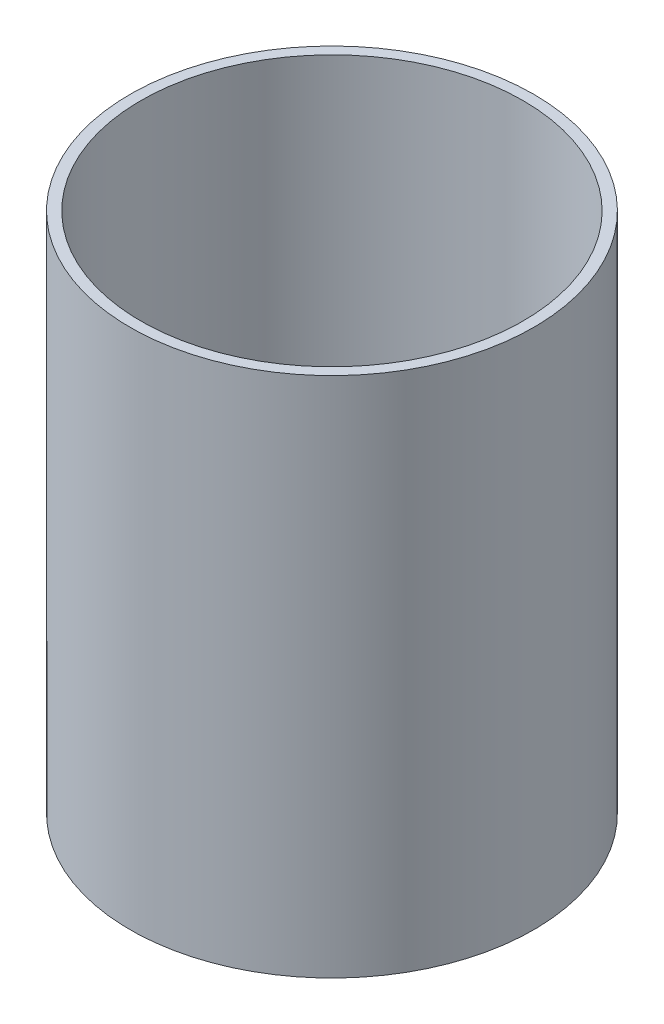
ISO-10303-21;
HEADER;
FILE_DESCRIPTION(('STEP AP214'),'2;1');
FILE_NAME('part.step','',(''),(''),'','','');
FILE_SCHEMA(('AUTOMOTIVE_DESIGN { 1 0 10303 214 1 1 1 1 }'));
ENDSEC;
DATA;
#1=APPLICATION_CONTEXT('core data for automotive mechanical design processes');
#2=APPLICATION_PROTOCOL_DEFINITION('international standard','automotive_design',2000,#1);
#3=PRODUCT_CONTEXT('',#1,'mechanical');
#4=PRODUCT('Part','Part','',(#3));
#5=PRODUCT_RELATED_PRODUCT_CATEGORY('part','',(#4));
#6=PRODUCT_DEFINITION_FORMATION('','',#4);
#7=PRODUCT_DEFINITION_CONTEXT('part definition',#1,'design');
#8=PRODUCT_DEFINITION('design','',#6,#7);
#9=PRODUCT_DEFINITION_SHAPE('','',#8);
#10=(LENGTH_UNIT() NAMED_UNIT(*) SI_UNIT(.MILLI.,.METRE.));
#11=(NAMED_UNIT(*) PLANE_ANGLE_UNIT() SI_UNIT($,.RADIAN.));
#12=(NAMED_UNIT(*) SI_UNIT($,.STERADIAN.) SOLID_ANGLE_UNIT());
#13=UNCERTAINTY_MEASURE_WITH_UNIT(LENGTH_MEASURE(1.E-05),#10,'distance_accuracy_value','');
#14=(GEOMETRIC_REPRESENTATION_CONTEXT(3) GLOBAL_UNCERTAINTY_ASSIGNED_CONTEXT((#13)) GLOBAL_UNIT_ASSIGNED_CONTEXT((#10,
#11,#12)) REPRESENTATION_CONTEXT('',''));
#15=CARTESIAN_POINT('',(0.,0.,0.));
#16=DIRECTION('',(0.,0.,1.));
#17=DIRECTION('',(1.,0.,0.));
#18=AXIS2_PLACEMENT_3D('',#15,#16,#17);
#19=CARTESIAN_POINT('',(0.,-13.97,0.));
#20=DIRECTION('',(0.,-1.,0.));
#21=DIRECTION('',(0.,0.,-1.));
#22=AXIS2_PLACEMENT_3D('',#19,#20,#21);
#23=CYLINDRICAL_SURFACE('',#22,26.9748);
#24=CARTESIAN_POINT('',(0.,0.,0.));
#25=DIRECTION('',(0.,-1.,0.));
#26=DIRECTION('',(0.,0.,-1.));
#27=AXIS2_PLACEMENT_3D('',#24,#25,#26);
#28=CIRCLE('',#27,26.9748);
#29=CARTESIAN_POINT('',(0.,0.,-26.9748));
#30=VERTEX_POINT('',#29);
#31=EDGE_CURVE('E48',#30,#30,#28,.T.);
#32=ORIENTED_EDGE('',*,*,#31,.T.);
#33=EDGE_LOOP('',(#32));
#34=FACE_BOUND('',#33,.T.);
#35=CARTESIAN_POINT('',(0.,73.66,0.));
#36=DIRECTION('',(0.,-1.,0.));
#37=DIRECTION('',(0.,0.,-1.));
#38=AXIS2_PLACEMENT_3D('',#35,#36,#37);
#39=CIRCLE('',#38,26.9748);
#40=CARTESIAN_POINT('',(0.,73.66,-26.9748));
#41=VERTEX_POINT('',#40);
#42=EDGE_CURVE('E10',#41,#41,#39,.T.);
#43=ORIENTED_EDGE('',*,*,#42,.F.);
#44=EDGE_LOOP('',(#43));
#45=FACE_BOUND('',#44,.T.);
#46=ADVANCED_FACE('F34',(#34,#45),#23,.F.);
#47=CARTESIAN_POINT('',(26.9748,73.66,0.));
#48=DIRECTION('',(0.,1.,0.));
#49=DIRECTION('',(0.,0.,1.));
#50=AXIS2_PLACEMENT_3D('',#47,#48,#49);
#51=PLANE('',#50);
#52=ORIENTED_EDGE('',*,*,#42,.T.);
#53=EDGE_LOOP('',(#52));
#54=FACE_BOUND('',#53,.T.);
#55=CARTESIAN_POINT('',(0.,73.66,0.));
#56=DIRECTION('',(0.,-1.,0.));
#57=DIRECTION('',(0.,0.,-1.));
#58=AXIS2_PLACEMENT_3D('',#55,#56,#57);
#59=CIRCLE('',#58,28.4988);
#60=CARTESIAN_POINT('',(0.,73.66,-28.4988));
#61=VERTEX_POINT('',#60);
#62=EDGE_CURVE('E40',#61,#61,#59,.T.);
#63=ORIENTED_EDGE('',*,*,#62,.F.);
#64=EDGE_LOOP('',(#63));
#65=FACE_BOUND('',#64,.T.);
#66=ADVANCED_FACE('F64',(#54,#65),#51,.T.);
#67=CARTESIAN_POINT('',(0.,-13.97,0.));
#68=DIRECTION('',(0.,-1.,0.));
#69=DIRECTION('',(0.,0.,-1.));
#70=AXIS2_PLACEMENT_3D('',#67,#68,#69);
#71=CYLINDRICAL_SURFACE('',#70,28.4988);
#72=ORIENTED_EDGE('',*,*,#62,.T.);
#73=EDGE_LOOP('',(#72));
#74=FACE_BOUND('',#73,.T.);
#75=CARTESIAN_POINT('',(0.,0.,0.));
#76=DIRECTION('',(0.,-1.,0.));
#77=DIRECTION('',(0.,0.,-1.));
#78=AXIS2_PLACEMENT_3D('',#75,#76,#77);
#79=CIRCLE('',#78,28.4988);
#80=CARTESIAN_POINT('',(0.,0.,-28.4988));
#81=VERTEX_POINT('',#80);
#82=EDGE_CURVE('E44',#81,#81,#79,.T.);
#83=ORIENTED_EDGE('',*,*,#82,.F.);
#84=EDGE_LOOP('',(#83));
#85=FACE_BOUND('',#84,.T.);
#86=ADVANCED_FACE('F58',(#74,#85),#71,.T.);
#87=CARTESIAN_POINT('',(26.9748,0.,0.));
#88=DIRECTION('',(0.,-1.,0.));
#89=DIRECTION('',(0.,0.,-1.));
#90=AXIS2_PLACEMENT_3D('',#87,#88,#89);
#91=PLANE('',#90);
#92=ORIENTED_EDGE('',*,*,#82,.T.);
#93=EDGE_LOOP('',(#92));
#94=FACE_BOUND('',#93,.T.);
#95=ORIENTED_EDGE('',*,*,#31,.F.);
#96=EDGE_LOOP('',(#95));
#97=FACE_BOUND('',#96,.T.);
#98=ADVANCED_FACE('F56',(#94,#97),#91,.T.);
#99=CLOSED_SHELL('',(#46,#66,#86,#98));
#100=MANIFOLD_SOLID_BREP('B2',#99);
#101=ADVANCED_BREP_SHAPE_REPRESENTATION('',(#18,#100),#14);
#102=SHAPE_DEFINITION_REPRESENTATION(#9,#101);
ENDSEC;
END-ISO-10303-21;
